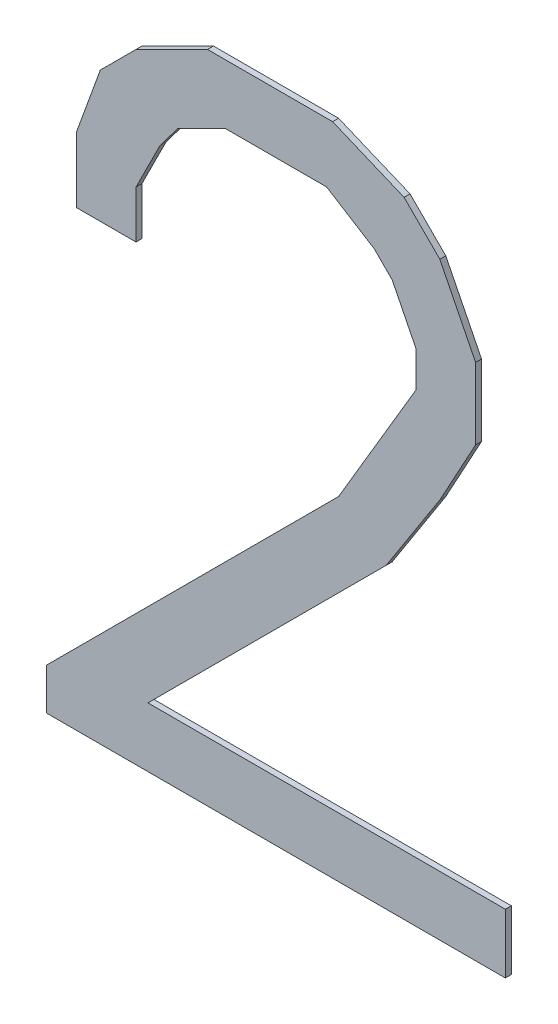
ISO-10303-21;
HEADER;
FILE_DESCRIPTION(('STEP AP214'),'2;1');
FILE_NAME('part.step','',(''),(''),'','','');
FILE_SCHEMA(('AUTOMOTIVE_DESIGN { 1 0 10303 214 1 1 1 1 }'));
ENDSEC;
DATA;
#1=APPLICATION_CONTEXT('core data for automotive mechanical design processes');
#2=APPLICATION_PROTOCOL_DEFINITION('international standard','automotive_design',2000,#1);
#3=PRODUCT_CONTEXT('',#1,'mechanical');
#4=PRODUCT('Part','Part','',(#3));
#5=PRODUCT_RELATED_PRODUCT_CATEGORY('part','',(#4));
#6=PRODUCT_DEFINITION_FORMATION('','',#4);
#7=PRODUCT_DEFINITION_CONTEXT('part definition',#1,'design');
#8=PRODUCT_DEFINITION('design','',#6,#7);
#9=PRODUCT_DEFINITION_SHAPE('','',#8);
#10=(LENGTH_UNIT() NAMED_UNIT(*) SI_UNIT(.MILLI.,.METRE.));
#11=(NAMED_UNIT(*) PLANE_ANGLE_UNIT() SI_UNIT($,.RADIAN.));
#12=(NAMED_UNIT(*) SI_UNIT($,.STERADIAN.) SOLID_ANGLE_UNIT());
#13=UNCERTAINTY_MEASURE_WITH_UNIT(LENGTH_MEASURE(1.E-05),#10,'distance_accuracy_value','');
#14=(GEOMETRIC_REPRESENTATION_CONTEXT(3) GLOBAL_UNCERTAINTY_ASSIGNED_CONTEXT((#13)) GLOBAL_UNIT_ASSIGNED_CONTEXT((#10,
#11,#12)) REPRESENTATION_CONTEXT('',''));
#15=CARTESIAN_POINT('',(0.,0.,0.));
#16=DIRECTION('',(0.,0.,1.));
#17=DIRECTION('',(1.,0.,0.));
#18=AXIS2_PLACEMENT_3D('',#15,#16,#17);
#19=CARTESIAN_POINT('',(-0.33499806,0.21000212,0.01));
#20=DIRECTION('',(0.,0.,-1.));
#21=DIRECTION('',(-1.,0.,0.));
#22=AXIS2_PLACEMENT_3D('',#19,#20,#21);
#23=PLANE('',#22);
#24=DIRECTION('',(-0.447213595499958,-0.894427190999916,0.));
#25=VECTOR('',#24,1.);
#26=CARTESIAN_POINT('',(-0.23499826,0.29000196,0.01));
#27=LINE('',#26,#25);
#28=CARTESIAN_POINT('',(-0.23499826,0.29000196,0.01));
#29=VERTEX_POINT('',#28);
#30=CARTESIAN_POINT('',(-0.19499834,0.3700018,0.01));
#31=VERTEX_POINT('',#30);
#32=EDGE_CURVE('E321',#29,#31,#27,.F.);
#33=ORIENTED_EDGE('',*,*,#32,.T.);
#34=DIRECTION('',(-0.6,-0.8,0.));
#35=VECTOR('',#34,1.);
#36=CARTESIAN_POINT('',(-0.19499834,0.3700018,0.01));
#37=LINE('',#36,#35);
#38=CARTESIAN_POINT('',(-0.1649984,0.41000172,0.01));
#39=VERTEX_POINT('',#38);
#40=EDGE_CURVE('E316',#31,#39,#37,.F.);
#41=ORIENTED_EDGE('',*,*,#40,.T.);
#42=DIRECTION('',(-0.894427190999916,-0.447213595499958,0.));
#43=VECTOR('',#42,1.);
#44=CARTESIAN_POINT('',(-0.1649984,0.41000172,0.01));
#45=LINE('',#44,#43);
#46=CARTESIAN_POINT('',(-0.0849985599999906,0.450001640000001,0.01));
#47=VERTEX_POINT('',#46);
#48=EDGE_CURVE('E312',#39,#47,#45,.F.);
#49=ORIENTED_EDGE('',*,*,#48,.T.);
#50=DIRECTION('',(1.,0.,0.));
#51=VECTOR('',#50,1.);
#52=CARTESIAN_POINT('',(-0.08499855999999,0.45000164,0.01));
#53=LINE('',#52,#51);
#54=CARTESIAN_POINT('',(0.08500110000001,0.45000164,0.01));
#55=VERTEX_POINT('',#54);
#56=EDGE_CURVE('E308',#47,#55,#53,.T.);
#57=ORIENTED_EDGE('',*,*,#56,.T.);
#58=DIRECTION('',(-0.847998304005144,0.52999894000309,0.));
#59=VECTOR('',#58,1.);
#60=CARTESIAN_POINT('',(0.08500110000001,0.45000164,0.01));
#61=LINE('',#60,#59);
#62=CARTESIAN_POINT('',(0.165000940000002,0.400001740000003,0.01));
#63=VERTEX_POINT('',#62);
#64=EDGE_CURVE('E304',#55,#63,#61,.F.);
#65=ORIENTED_EDGE('',*,*,#64,.T.);
#66=DIRECTION('',(-0.707106781186548,0.707106781186548,0.));
#67=VECTOR('',#66,1.);
#68=CARTESIAN_POINT('',(0.16500094,0.40000174,0.01));
#69=LINE('',#68,#67);
#70=CARTESIAN_POINT('',(0.19500088,0.3700018,0.01));
#71=VERTEX_POINT('',#70);
#72=EDGE_CURVE('E300',#63,#71,#69,.F.);
#73=ORIENTED_EDGE('',*,*,#72,.T.);
#74=DIRECTION('',(-0.447213595499958,0.894427190999916,0.));
#75=VECTOR('',#74,1.);
#76=CARTESIAN_POINT('',(0.19500088,0.3700018,0.01));
#77=LINE('',#76,#75);
#78=CARTESIAN_POINT('',(0.2350008,0.29000196,0.01));
#79=VERTEX_POINT('',#78);
#80=EDGE_CURVE('E296',#71,#79,#77,.F.);
#81=ORIENTED_EDGE('',*,*,#80,.T.);
#82=DIRECTION('',(0.,1.,0.));
#83=VECTOR('',#82,1.);
#84=CARTESIAN_POINT('',(0.2350008,0.29000196,0.01));
#85=LINE('',#84,#83);
#86=CARTESIAN_POINT('',(0.2350008,0.23000208,0.01));
#87=VERTEX_POINT('',#86);
#88=EDGE_CURVE('E292',#79,#87,#85,.F.);
#89=ORIENTED_EDGE('',*,*,#88,.T.);
#90=DIRECTION('',(0.508729312127045,0.860926528214077,0.));
#91=VECTOR('',#90,1.);
#92=CARTESIAN_POINT('',(0.2350008,0.23000208,0.01));
#93=LINE('',#92,#91);
#94=CARTESIAN_POINT('',(0.105001059999979,0.0100025200000318,0.01));
#95=VERTEX_POINT('',#94);
#96=EDGE_CURVE('E288',#87,#95,#93,.F.);
#97=ORIENTED_EDGE('',*,*,#96,.T.);
#98=DIRECTION('',(0.707104948480173,0.707108613888172,0.));
#99=VECTOR('',#98,1.);
#100=CARTESIAN_POINT('',(0.10500106,0.01000252,0.01));
#101=LINE('',#100,#99);
#102=CARTESIAN_POINT('',(-0.384997960000043,-0.479999039999957,0.01));
#103=VERTEX_POINT('',#102);
#104=EDGE_CURVE('E284',#95,#103,#101,.F.);
#105=ORIENTED_EDGE('',*,*,#104,.T.);
#106=DIRECTION('',(0.,1.,0.));
#107=VECTOR('',#106,1.);
#108=CARTESIAN_POINT('',(-0.38499796,-0.47999904,0.01));
#109=LINE('',#108,#107);
#110=CARTESIAN_POINT('',(-0.38499796,-0.5499989,0.01));
#111=VERTEX_POINT('',#110);
#112=EDGE_CURVE('E280',#103,#111,#109,.F.);
#113=ORIENTED_EDGE('',*,*,#112,.T.);
#114=DIRECTION('',(1.,0.,0.));
#115=VECTOR('',#114,1.);
#116=CARTESIAN_POINT('',(-0.38499796,-0.5499989,0.01));
#117=LINE('',#116,#115);
#118=CARTESIAN_POINT('',(0.3850005,-0.5499989,0.01));
#119=VERTEX_POINT('',#118);
#120=EDGE_CURVE('E276',#111,#119,#117,.T.);
#121=ORIENTED_EDGE('',*,*,#120,.T.);
#122=DIRECTION('',(0.,1.,0.));
#123=VECTOR('',#122,1.);
#124=CARTESIAN_POINT('',(0.3850005,-0.5499989,0.01));
#125=LINE('',#124,#123);
#126=CARTESIAN_POINT('',(0.3850005,-0.4499991,0.01));
#127=VERTEX_POINT('',#126);
#128=EDGE_CURVE('E272',#119,#127,#125,.T.);
#129=ORIENTED_EDGE('',*,*,#128,.T.);
#130=DIRECTION('',(1.,0.,0.));
#131=VECTOR('',#130,1.);
#132=CARTESIAN_POINT('',(0.3850005,-0.4499991,0.01));
#133=LINE('',#132,#131);
#134=CARTESIAN_POINT('',(-0.2149983,-0.4499991,0.01));
#135=VERTEX_POINT('',#134);
#136=EDGE_CURVE('E268',#127,#135,#133,.F.);
#137=ORIENTED_EDGE('',*,*,#136,.T.);
#138=DIRECTION('',(-0.707104536121984,-0.707109026243984,0.));
#139=VECTOR('',#138,1.);
#140=CARTESIAN_POINT('',(-0.2149983,-0.4499991,0.01));
#141=LINE('',#140,#139);
#142=CARTESIAN_POINT('',(0.185000900000042,-0.0499973600000949,0.01));
#143=VERTEX_POINT('',#142);
#144=EDGE_CURVE('E264',#135,#143,#141,.F.);
#145=ORIENTED_EDGE('',*,*,#144,.T.);
#146=DIRECTION('',(-0.540757591314105,-0.841178475376164,0.));
#147=VECTOR('',#146,1.);
#148=CARTESIAN_POINT('',(0.1850009,-0.04999735999999,0.01));
#149=LINE('',#148,#147);
#150=CARTESIAN_POINT('',(0.27500072000002,0.0900023599999678,0.01));
#151=VERTEX_POINT('',#150);
#152=EDGE_CURVE('E260',#143,#151,#149,.F.);
#153=ORIENTED_EDGE('',*,*,#152,.T.);
#154=DIRECTION('',(-0.478852130679873,-0.877895572914767,0.));
#155=VECTOR('',#154,1.);
#156=CARTESIAN_POINT('',(0.27500072,0.09000236,0.01));
#157=LINE('',#156,#155);
#158=CARTESIAN_POINT('',(0.335000599999978,0.200002140000012,0.01));
#159=VERTEX_POINT('',#158);
#160=EDGE_CURVE('E256',#151,#159,#157,.F.);
#161=ORIENTED_EDGE('',*,*,#160,.T.);
#162=DIRECTION('',(0.,1.,0.));
#163=VECTOR('',#162,1.);
#164=CARTESIAN_POINT('',(0.3350006,0.20000214,0.01));
#165=LINE('',#164,#163);
#166=CARTESIAN_POINT('',(0.3350006,0.3200019,0.01));
#167=VERTEX_POINT('',#166);
#168=EDGE_CURVE('E252',#159,#167,#165,.T.);
#169=ORIENTED_EDGE('',*,*,#168,.T.);
#170=DIRECTION('',(0.447213595499958,-0.894427190999916,0.));
#171=VECTOR('',#170,1.);
#172=CARTESIAN_POINT('',(0.3350006,0.3200019,0.01));
#173=LINE('',#172,#171);
#174=CARTESIAN_POINT('',(0.27500072,0.44000166,0.01));
#175=VERTEX_POINT('',#174);
#176=EDGE_CURVE('E248',#167,#175,#173,.F.);
#177=ORIENTED_EDGE('',*,*,#176,.T.);
#178=DIRECTION('',(0.707106781186548,-0.707106781186548,0.));
#179=VECTOR('',#178,1.);
#180=CARTESIAN_POINT('',(0.27500072,0.44000166,0.01));
#181=LINE('',#180,#179);
#182=CARTESIAN_POINT('',(0.21500084,0.50000154,0.01));
#183=VERTEX_POINT('',#182);
#184=EDGE_CURVE('E244',#175,#183,#181,.F.);
#185=ORIENTED_EDGE('',*,*,#184,.T.);
#186=DIRECTION('',(0.923076923077071,-0.38461538461503,0.));
#187=VECTOR('',#186,1.);
#188=CARTESIAN_POINT('',(0.21500084,0.50000154,0.01));
#189=LINE('',#188,#187);
#190=CARTESIAN_POINT('',(0.0950010799999954,0.550001439999988,0.01));
#191=VERTEX_POINT('',#190);
#192=EDGE_CURVE('E240',#183,#191,#189,.F.);
#193=ORIENTED_EDGE('',*,*,#192,.T.);
#194=DIRECTION('',(1.,0.,0.));
#195=VECTOR('',#194,1.);
#196=CARTESIAN_POINT('',(0.09500108,0.55000144,0.01));
#197=LINE('',#196,#195);
#198=CARTESIAN_POINT('',(-0.1149985,0.55000144,0.01));
#199=VERTEX_POINT('',#198);
#200=EDGE_CURVE('E236',#191,#199,#197,.F.);
#201=ORIENTED_EDGE('',*,*,#200,.T.);
#202=DIRECTION('',(0.894427190999916,0.447213595499958,0.));
#203=VECTOR('',#202,1.);
#204=CARTESIAN_POINT('',(-0.1149985,0.55000144,0.01));
#205=LINE('',#204,#203);
#206=CARTESIAN_POINT('',(-0.23499826,0.49000156,0.01));
#207=VERTEX_POINT('',#206);
#208=EDGE_CURVE('E232',#199,#207,#205,.F.);
#209=ORIENTED_EDGE('',*,*,#208,.T.);
#210=DIRECTION('',(0.707106781186048,0.707106781187048,0.));
#211=VECTOR('',#210,1.);
#212=CARTESIAN_POINT('',(-0.23499826,0.49000156,0.01));
#213=LINE('',#212,#211);
#214=CARTESIAN_POINT('',(-0.294998139999989,0.430001679999989,0.01));
#215=VERTEX_POINT('',#214);
#216=EDGE_CURVE('E228',#207,#215,#213,.F.);
#217=ORIENTED_EDGE('',*,*,#216,.T.);
#218=DIRECTION('',(0.341743063087106,0.939793423488291,0.));
#219=VECTOR('',#218,1.);
#220=CARTESIAN_POINT('',(-0.29499814,0.43000168,0.01));
#221=LINE('',#220,#219);
#222=CARTESIAN_POINT('',(-0.334998060000012,0.320001900000004,0.01));
#223=VERTEX_POINT('',#222);
#224=EDGE_CURVE('E224',#215,#223,#221,.F.);
#225=ORIENTED_EDGE('',*,*,#224,.T.);
#226=DIRECTION('',(0.,1.,0.));
#227=VECTOR('',#226,1.);
#228=CARTESIAN_POINT('',(-0.33499806,0.3200019,0.01));
#229=LINE('',#228,#227);
#230=CARTESIAN_POINT('',(-0.33499806,0.21000212,0.01));
#231=VERTEX_POINT('',#230);
#232=EDGE_CURVE('E200',#223,#231,#229,.F.);
#233=ORIENTED_EDGE('',*,*,#232,.T.);
#234=DIRECTION('',(1.,0.,0.));
#235=VECTOR('',#234,1.);
#236=CARTESIAN_POINT('',(-0.33499806,0.21000212,0.01));
#237=LINE('',#236,#235);
#238=CARTESIAN_POINT('',(-0.23499826,0.21000212,0.01));
#239=VERTEX_POINT('',#238);
#240=EDGE_CURVE('E202',#231,#239,#237,.T.);
#241=ORIENTED_EDGE('',*,*,#240,.T.);
#242=DIRECTION('',(0.,1.,0.));
#243=VECTOR('',#242,1.);
#244=CARTESIAN_POINT('',(-0.23499826,0.21000212,0.01));
#245=LINE('',#244,#243);
#246=EDGE_CURVE('E20',#239,#29,#245,.T.);
#247=ORIENTED_EDGE('',*,*,#246,.T.);
#248=EDGE_LOOP('',(#33,#41,#49,#57,#65,#73,#81,#89,#97,#105,#113,#121,#129,#137,#145,#153,#161,
#169,#177,#185,#193,#201,#209,#217,#225,#233,#241,#247));
#249=FACE_BOUND('',#248,.T.);
#250=ADVANCED_FACE('F17',(#249),#23,.F.);
#251=CARTESIAN_POINT('',(-0.23499826,0.21000212,0.));
#252=DIRECTION('',(-1.,0.,0.));
#253=DIRECTION('',(0.,0.,1.));
#254=AXIS2_PLACEMENT_3D('',#251,#252,#253);
#255=PLANE('',#254);
#256=ORIENTED_EDGE('',*,*,#246,.F.);
#257=DIRECTION('',(0.,0.,1.));
#258=VECTOR('',#257,1.);
#259=CARTESIAN_POINT('',(-0.23499826,0.21000212,0.));
#260=LINE('',#259,#258);
#261=CARTESIAN_POINT('',(-0.23499826,0.21000212,0.));
#262=VERTEX_POINT('',#261);
#263=EDGE_CURVE('E208',#239,#262,#260,.F.);
#264=ORIENTED_EDGE('',*,*,#263,.T.);
#265=DIRECTION('',(0.,1.,0.));
#266=VECTOR('',#265,1.);
#267=CARTESIAN_POINT('',(-0.23499826,0.21000212,0.));
#268=LINE('',#267,#266);
#269=CARTESIAN_POINT('',(-0.23499826,0.29000196,0.));
#270=VERTEX_POINT('',#269);
#271=EDGE_CURVE('E324',#270,#262,#268,.F.);
#272=ORIENTED_EDGE('',*,*,#271,.F.);
#273=DIRECTION('',(0.,0.,1.));
#274=VECTOR('',#273,1.);
#275=CARTESIAN_POINT('',(-0.23499826,0.29000196,0.));
#276=LINE('',#275,#274);
#277=EDGE_CURVE('E213',#270,#29,#276,.T.);
#278=ORIENTED_EDGE('',*,*,#277,.T.);
#279=EDGE_LOOP('',(#256,#264,#272,#278));
#280=FACE_BOUND('',#279,.T.);
#281=ADVANCED_FACE('F210',(#280),#255,.F.);
#282=CARTESIAN_POINT('',(-0.33499806,0.21000212,0.));
#283=DIRECTION('',(0.,1.,0.));
#284=DIRECTION('',(0.,0.,1.));
#285=AXIS2_PLACEMENT_3D('',#282,#283,#284);
#286=PLANE('',#285);
#287=ORIENTED_EDGE('',*,*,#240,.F.);
#288=DIRECTION('',(0.,0.,-1.));
#289=VECTOR('',#288,1.);
#290=CARTESIAN_POINT('',(-0.33499806,0.21000212,0.));
#291=LINE('',#290,#289);
#292=CARTESIAN_POINT('',(-0.33499806,0.21000212,0.));
#293=VERTEX_POINT('',#292);
#294=EDGE_CURVE('E220',#231,#293,#291,.T.);
#295=ORIENTED_EDGE('',*,*,#294,.T.);
#296=DIRECTION('',(-1.,0.,0.));
#297=VECTOR('',#296,1.);
#298=CARTESIAN_POINT('',(-0.33499806,0.21000212,0.));
#299=LINE('',#298,#297);
#300=EDGE_CURVE('E217',#262,#293,#299,.T.);
#301=ORIENTED_EDGE('',*,*,#300,.F.);
#302=ORIENTED_EDGE('',*,*,#263,.F.);
#303=EDGE_LOOP('',(#287,#295,#301,#302));
#304=FACE_BOUND('',#303,.T.);
#305=ADVANCED_FACE('F215',(#304),#286,.F.);
#306=CARTESIAN_POINT('',(-0.33499806,0.3200019,0.));
#307=DIRECTION('',(1.,0.,0.));
#308=DIRECTION('',(0.,0.,-1.));
#309=AXIS2_PLACEMENT_3D('',#306,#307,#308);
#310=PLANE('',#309);
#311=ORIENTED_EDGE('',*,*,#232,.F.);
#312=DIRECTION('',(0.,0.,1.));
#313=VECTOR('',#312,1.);
#314=CARTESIAN_POINT('',(-0.334998060000047,0.320001900000017,0.));
#315=LINE('',#314,#313);
#316=CARTESIAN_POINT('',(-0.334998060000012,0.320001900000004,0.));
#317=VERTEX_POINT('',#316);
#318=EDGE_CURVE('E226',#223,#317,#315,.F.);
#319=ORIENTED_EDGE('',*,*,#318,.T.);
#320=DIRECTION('',(0.,1.,0.));
#321=VECTOR('',#320,1.);
#322=CARTESIAN_POINT('',(-0.33499806,0.21000212,0.));
#323=LINE('',#322,#321);
#324=EDGE_CURVE('E327',#293,#317,#323,.T.);
#325=ORIENTED_EDGE('',*,*,#324,.F.);
#326=ORIENTED_EDGE('',*,*,#294,.F.);
#327=EDGE_LOOP('',(#311,#319,#325,#326));
#328=FACE_BOUND('',#327,.T.);
#329=ADVANCED_FACE('F520',(#328),#310,.F.);
#330=CARTESIAN_POINT('',(-0.29499814,0.43000168,0.));
#331=DIRECTION('',(0.939793423488291,-0.341743063087106,0.));
#332=DIRECTION('',(0.341743063087106,0.939793423488291,0.));
#333=AXIS2_PLACEMENT_3D('',#330,#331,#332);
#334=PLANE('',#333);
#335=ORIENTED_EDGE('',*,*,#224,.F.);
#336=DIRECTION('',(0.,0.,1.));
#337=VECTOR('',#336,1.);
#338=CARTESIAN_POINT('',(-0.294998139999958,0.430001679999958,0.));
#339=LINE('',#338,#337);
#340=CARTESIAN_POINT('',(-0.294998139999989,0.430001679999989,0.));
#341=VERTEX_POINT('',#340);
#342=EDGE_CURVE('E230',#215,#341,#339,.F.);
#343=ORIENTED_EDGE('',*,*,#342,.T.);
#344=DIRECTION('',(0.341743063086704,0.939793423488437,0.));
#345=VECTOR('',#344,1.);
#346=CARTESIAN_POINT('',(-0.33499806,0.3200019,0.));
#347=LINE('',#346,#345);
#348=EDGE_CURVE('E330',#317,#341,#347,.T.);
#349=ORIENTED_EDGE('',*,*,#348,.F.);
#350=ORIENTED_EDGE('',*,*,#318,.F.);
#351=EDGE_LOOP('',(#335,#343,#349,#350));
#352=FACE_BOUND('',#351,.T.);
#353=ADVANCED_FACE('F517',(#352),#334,.F.);
#354=CARTESIAN_POINT('',(-0.23499826,0.49000156,0.));
#355=DIRECTION('',(0.707106781187048,-0.707106781186048,0.));
#356=DIRECTION('',(0.707106781186048,0.707106781187048,0.));
#357=AXIS2_PLACEMENT_3D('',#354,#355,#356);
#358=PLANE('',#357);
#359=ORIENTED_EDGE('',*,*,#216,.F.);
#360=DIRECTION('',(0.,0.,1.));
#361=VECTOR('',#360,1.);
#362=CARTESIAN_POINT('',(-0.23499826,0.49000156,0.));
#363=LINE('',#362,#361);
#364=CARTESIAN_POINT('',(-0.23499826,0.49000156,0.));
#365=VERTEX_POINT('',#364);
#366=EDGE_CURVE('E234',#207,#365,#363,.F.);
#367=ORIENTED_EDGE('',*,*,#366,.T.);
#368=DIRECTION('',(0.707106781186548,0.707106781186548,0.));
#369=VECTOR('',#368,1.);
#370=CARTESIAN_POINT('',(-0.29499814,0.43000168,0.));
#371=LINE('',#370,#369);
#372=EDGE_CURVE('E333',#341,#365,#371,.T.);
#373=ORIENTED_EDGE('',*,*,#372,.F.);
#374=ORIENTED_EDGE('',*,*,#342,.F.);
#375=EDGE_LOOP('',(#359,#367,#373,#374));
#376=FACE_BOUND('',#375,.T.);
#377=ADVANCED_FACE('F513',(#376),#358,.F.);
#378=CARTESIAN_POINT('',(-0.1149985,0.55000144,0.));
#379=DIRECTION('',(0.447213595499958,-0.894427190999916,0.));
#380=DIRECTION('',(0.894427190999916,0.447213595499958,0.));
#381=AXIS2_PLACEMENT_3D('',#378,#379,#380);
#382=PLANE('',#381);
#383=ORIENTED_EDGE('',*,*,#208,.F.);
#384=DIRECTION('',(0.,0.,-1.));
#385=VECTOR('',#384,1.);
#386=CARTESIAN_POINT('',(-0.1149985,0.55000144,0.));
#387=LINE('',#386,#385);
#388=CARTESIAN_POINT('',(-0.1149985,0.55000144,0.));
#389=VERTEX_POINT('',#388);
#390=EDGE_CURVE('E238',#199,#389,#387,.T.);
#391=ORIENTED_EDGE('',*,*,#390,.T.);
#392=DIRECTION('',(0.894427190999916,0.447213595499957,0.));
#393=VECTOR('',#392,1.);
#394=CARTESIAN_POINT('',(-0.23499826,0.49000156,0.));
#395=LINE('',#394,#393);
#396=EDGE_CURVE('E336',#365,#389,#395,.T.);
#397=ORIENTED_EDGE('',*,*,#396,.F.);
#398=ORIENTED_EDGE('',*,*,#366,.F.);
#399=EDGE_LOOP('',(#383,#391,#397,#398));
#400=FACE_BOUND('',#399,.T.);
#401=ADVANCED_FACE('F507',(#400),#382,.F.);
#402=CARTESIAN_POINT('',(0.09500108,0.55000144,0.));
#403=DIRECTION('',(0.,-1.,0.));
#404=DIRECTION('',(0.,0.,-1.));
#405=AXIS2_PLACEMENT_3D('',#402,#403,#404);
#406=PLANE('',#405);
#407=ORIENTED_EDGE('',*,*,#200,.F.);
#408=DIRECTION('',(0.,0.,1.));
#409=VECTOR('',#408,1.);
#410=CARTESIAN_POINT('',(0.0950010799999808,0.550001439999954,0.));
#411=LINE('',#410,#409);
#412=CARTESIAN_POINT('',(0.0950010799999953,0.550001439999988,0.));
#413=VERTEX_POINT('',#412);
#414=EDGE_CURVE('E242',#191,#413,#411,.F.);
#415=ORIENTED_EDGE('',*,*,#414,.T.);
#416=DIRECTION('',(-1.,0.,0.));
#417=VECTOR('',#416,1.);
#418=CARTESIAN_POINT('',(-0.33499806,0.55000144,0.));
#419=LINE('',#418,#417);
#420=EDGE_CURVE('E339',#389,#413,#419,.F.);
#421=ORIENTED_EDGE('',*,*,#420,.F.);
#422=ORIENTED_EDGE('',*,*,#390,.F.);
#423=EDGE_LOOP('',(#407,#415,#421,#422));
#424=FACE_BOUND('',#423,.T.);
#425=ADVANCED_FACE('F503',(#424),#406,.F.);
#426=CARTESIAN_POINT('',(0.21500084,0.50000154,0.));
#427=DIRECTION('',(-0.38461538461503,-0.923076923077071,0.));
#428=DIRECTION('',(0.923076923077071,-0.38461538461503,0.));
#429=AXIS2_PLACEMENT_3D('',#426,#427,#428);
#430=PLANE('',#429);
#431=ORIENTED_EDGE('',*,*,#192,.F.);
#432=DIRECTION('',(0.,0.,1.));
#433=VECTOR('',#432,1.);
#434=CARTESIAN_POINT('',(0.21500084,0.50000154,0.));
#435=LINE('',#434,#433);
#436=CARTESIAN_POINT('',(0.21500084,0.50000154,0.));
#437=VERTEX_POINT('',#436);
#438=EDGE_CURVE('E246',#183,#437,#435,.F.);
#439=ORIENTED_EDGE('',*,*,#438,.T.);
#440=DIRECTION('',(0.923076923076923,-0.384615384615385,0.));
#441=VECTOR('',#440,1.);
#442=CARTESIAN_POINT('',(0.09500108,0.55000144,0.));
#443=LINE('',#442,#441);
#444=EDGE_CURVE('E342',#413,#437,#443,.T.);
#445=ORIENTED_EDGE('',*,*,#444,.F.);
#446=ORIENTED_EDGE('',*,*,#414,.F.);
#447=EDGE_LOOP('',(#431,#439,#445,#446));
#448=FACE_BOUND('',#447,.T.);
#449=ADVANCED_FACE('F497',(#448),#430,.F.);
#450=CARTESIAN_POINT('',(0.27500072,0.44000166,0.));
#451=DIRECTION('',(-0.707106781186548,-0.707106781186548,0.));
#452=DIRECTION('',(0.707106781186548,-0.707106781186548,0.));
#453=AXIS2_PLACEMENT_3D('',#450,#451,#452);
#454=PLANE('',#453);
#455=ORIENTED_EDGE('',*,*,#184,.F.);
#456=DIRECTION('',(0.,0.,1.));
#457=VECTOR('',#456,1.);
#458=CARTESIAN_POINT('',(0.27500072,0.44000166,0.));
#459=LINE('',#458,#457);
#460=CARTESIAN_POINT('',(0.27500072,0.44000166,0.));
#461=VERTEX_POINT('',#460);
#462=EDGE_CURVE('E250',#175,#461,#459,.F.);
#463=ORIENTED_EDGE('',*,*,#462,.T.);
#464=DIRECTION('',(0.707106781186548,-0.707106781186547,0.));
#465=VECTOR('',#464,1.);
#466=CARTESIAN_POINT('',(0.21500084,0.50000154,0.));
#467=LINE('',#466,#465);
#468=EDGE_CURVE('E345',#437,#461,#467,.T.);
#469=ORIENTED_EDGE('',*,*,#468,.F.);
#470=ORIENTED_EDGE('',*,*,#438,.F.);
#471=EDGE_LOOP('',(#455,#463,#469,#470));
#472=FACE_BOUND('',#471,.T.);
#473=ADVANCED_FACE('F493',(#472),#454,.F.);
#474=CARTESIAN_POINT('',(0.3350006,0.3200019,0.));
#475=DIRECTION('',(-0.894427190999916,-0.447213595499958,0.));
#476=DIRECTION('',(0.447213595499958,-0.894427190999916,0.));
#477=AXIS2_PLACEMENT_3D('',#474,#475,#476);
#478=PLANE('',#477);
#479=ORIENTED_EDGE('',*,*,#176,.F.);
#480=DIRECTION('',(0.,0.,1.));
#481=VECTOR('',#480,1.);
#482=CARTESIAN_POINT('',(0.3350006,0.3200019,0.));
#483=LINE('',#482,#481);
#484=CARTESIAN_POINT('',(0.3350006,0.3200019,0.));
#485=VERTEX_POINT('',#484);
#486=EDGE_CURVE('E254',#167,#485,#483,.F.);
#487=ORIENTED_EDGE('',*,*,#486,.T.);
#488=DIRECTION('',(0.447213595499958,-0.894427190999916,0.));
#489=VECTOR('',#488,1.);
#490=CARTESIAN_POINT('',(0.27500072,0.44000166,0.));
#491=LINE('',#490,#489);
#492=EDGE_CURVE('E348',#461,#485,#491,.T.);
#493=ORIENTED_EDGE('',*,*,#492,.F.);
#494=ORIENTED_EDGE('',*,*,#462,.F.);
#495=EDGE_LOOP('',(#479,#487,#493,#494));
#496=FACE_BOUND('',#495,.T.);
#497=ADVANCED_FACE('F487',(#496),#478,.F.);
#498=CARTESIAN_POINT('',(0.3350006,0.20000214,0.));
#499=DIRECTION('',(-1.,0.,0.));
#500=DIRECTION('',(0.,0.,1.));
#501=AXIS2_PLACEMENT_3D('',#498,#499,#500);
#502=PLANE('',#501);
#503=ORIENTED_EDGE('',*,*,#168,.F.);
#504=DIRECTION('',(0.,0.,1.));
#505=VECTOR('',#504,1.);
#506=CARTESIAN_POINT('',(0.335000599999912,0.200002140000048,0.));
#507=LINE('',#506,#505);
#508=CARTESIAN_POINT('',(0.335000599999978,0.200002140000012,0.));
#509=VERTEX_POINT('',#508);
#510=EDGE_CURVE('E258',#159,#509,#507,.F.);
#511=ORIENTED_EDGE('',*,*,#510,.T.);
#512=DIRECTION('',(0.,1.,0.));
#513=VECTOR('',#512,1.);
#514=CARTESIAN_POINT('',(0.3350006,0.21000212,0.));
#515=LINE('',#514,#513);
#516=EDGE_CURVE('E351',#485,#509,#515,.F.);
#517=ORIENTED_EDGE('',*,*,#516,.F.);
#518=ORIENTED_EDGE('',*,*,#486,.F.);
#519=EDGE_LOOP('',(#503,#511,#517,#518));
#520=FACE_BOUND('',#519,.T.);
#521=ADVANCED_FACE('F483',(#520),#502,.F.);
#522=CARTESIAN_POINT('',(0.27500072,0.09000236,0.));
#523=DIRECTION('',(-0.877895572914767,0.478852130679873,0.));
#524=DIRECTION('',(-0.478852130679873,-0.877895572914767,0.));
#525=AXIS2_PLACEMENT_3D('',#522,#523,#524);
#526=PLANE('',#525);
#527=ORIENTED_EDGE('',*,*,#160,.F.);
#528=DIRECTION('',(0.,0.,1.));
#529=VECTOR('',#528,1.);
#530=CARTESIAN_POINT('',(0.275000720000087,0.0900023599999239,0.));
#531=LINE('',#530,#529);
#532=CARTESIAN_POINT('',(0.275000720000018,0.0900023599999686,0.));
#533=VERTEX_POINT('',#532);
#534=EDGE_CURVE('E262',#151,#533,#531,.F.);
#535=ORIENTED_EDGE('',*,*,#534,.T.);
#536=DIRECTION('',(-0.478852130680506,-0.877895572914421,0.));
#537=VECTOR('',#536,1.);
#538=CARTESIAN_POINT('',(0.3350006,0.20000214,0.));
#539=LINE('',#538,#537);
#540=EDGE_CURVE('E354',#509,#533,#539,.T.);
#541=ORIENTED_EDGE('',*,*,#540,.F.);
#542=ORIENTED_EDGE('',*,*,#510,.F.);
#543=EDGE_LOOP('',(#527,#535,#541,#542));
#544=FACE_BOUND('',#543,.T.);
#545=ADVANCED_FACE('F477',(#544),#526,.F.);
#546=CARTESIAN_POINT('',(0.1850009,-0.04999735999999,0.));
#547=DIRECTION('',(-0.841178475376164,0.540757591314105,0.));
#548=DIRECTION('',(-0.540757591314105,-0.841178475376164,0.));
#549=AXIS2_PLACEMENT_3D('',#546,#547,#548);
#550=PLANE('',#549);
#551=ORIENTED_EDGE('',*,*,#152,.F.);
#552=DIRECTION('',(0.,0.,1.));
#553=VECTOR('',#552,1.);
#554=CARTESIAN_POINT('',(0.185000900000197,-0.0499973600002469,0.));
#555=LINE('',#554,#553);
#556=CARTESIAN_POINT('',(0.185000900000036,-0.0499973600000905,0.));
#557=VERTEX_POINT('',#556);
#558=EDGE_CURVE('E266',#143,#557,#555,.F.);
#559=ORIENTED_EDGE('',*,*,#558,.T.);
#560=DIRECTION('',(-0.540757591313417,-0.841178475376606,0.));
#561=VECTOR('',#560,1.);
#562=CARTESIAN_POINT('',(0.27500072,0.09000235999998,0.));
#563=LINE('',#562,#561);
#564=EDGE_CURVE('E357',#533,#557,#563,.T.);
#565=ORIENTED_EDGE('',*,*,#564,.F.);
#566=ORIENTED_EDGE('',*,*,#534,.F.);
#567=EDGE_LOOP('',(#551,#559,#565,#566));
#568=FACE_BOUND('',#567,.T.);
#569=ADVANCED_FACE('F473',(#568),#550,.F.);
#570=CARTESIAN_POINT('',(-0.2149983,-0.4499991,0.));
#571=DIRECTION('',(-0.707109026243984,0.707104536121984,0.));
#572=DIRECTION('',(-0.707104536121984,-0.707109026243984,0.));
#573=AXIS2_PLACEMENT_3D('',#570,#571,#572);
#574=PLANE('',#573);
#575=ORIENTED_EDGE('',*,*,#144,.F.);
#576=DIRECTION('',(0.,0.,-1.));
#577=VECTOR('',#576,1.);
#578=CARTESIAN_POINT('',(-0.2149983,-0.4499991,0.));
#579=LINE('',#578,#577);
#580=CARTESIAN_POINT('',(-0.2149983,-0.4499991,0.));
#581=VERTEX_POINT('',#580);
#582=EDGE_CURVE('E270',#135,#581,#579,.T.);
#583=ORIENTED_EDGE('',*,*,#582,.T.);
#584=DIRECTION('',(-0.707104536121635,-0.707109026244332,0.));
#585=VECTOR('',#584,1.);
#586=CARTESIAN_POINT('',(0.1850009,-0.04999736000005,0.));
#587=LINE('',#586,#585);
#588=EDGE_CURVE('E360',#557,#581,#587,.T.);
#589=ORIENTED_EDGE('',*,*,#588,.F.);
#590=ORIENTED_EDGE('',*,*,#558,.F.);
#591=EDGE_LOOP('',(#575,#583,#589,#590));
#592=FACE_BOUND('',#591,.T.);
#593=ADVANCED_FACE('F467',(#592),#574,.F.);
#594=CARTESIAN_POINT('',(0.3850005,-0.4499991,0.));
#595=DIRECTION('',(0.,-1.,0.));
#596=DIRECTION('',(0.,0.,-1.));
#597=AXIS2_PLACEMENT_3D('',#594,#595,#596);
#598=PLANE('',#597);
#599=ORIENTED_EDGE('',*,*,#136,.F.);
#600=DIRECTION('',(0.,0.,1.));
#601=VECTOR('',#600,1.);
#602=CARTESIAN_POINT('',(0.3850005,-0.4499991,0.));
#603=LINE('',#602,#601);
#604=CARTESIAN_POINT('',(0.3850005,-0.4499991,0.));
#605=VERTEX_POINT('',#604);
#606=EDGE_CURVE('E274',#127,#605,#603,.F.);
#607=ORIENTED_EDGE('',*,*,#606,.T.);
#608=DIRECTION('',(-1.,0.,0.));
#609=VECTOR('',#608,1.);
#610=CARTESIAN_POINT('',(-0.33499806,-0.4499991,0.));
#611=LINE('',#610,#609);
#612=EDGE_CURVE('E363',#581,#605,#611,.F.);
#613=ORIENTED_EDGE('',*,*,#612,.F.);
#614=ORIENTED_EDGE('',*,*,#582,.F.);
#615=EDGE_LOOP('',(#599,#607,#613,#614));
#616=FACE_BOUND('',#615,.T.);
#617=ADVANCED_FACE('F463',(#616),#598,.F.);
#618=CARTESIAN_POINT('',(0.3850005,-0.5499989,0.));
#619=DIRECTION('',(-1.,0.,0.));
#620=DIRECTION('',(0.,0.,1.));
#621=AXIS2_PLACEMENT_3D('',#618,#619,#620);
#622=PLANE('',#621);
#623=ORIENTED_EDGE('',*,*,#128,.F.);
#624=DIRECTION('',(0.,0.,1.));
#625=VECTOR('',#624,1.);
#626=CARTESIAN_POINT('',(0.3850005,-0.5499989,0.));
#627=LINE('',#626,#625);
#628=CARTESIAN_POINT('',(0.3850005,-0.5499989,0.));
#629=VERTEX_POINT('',#628);
#630=EDGE_CURVE('E278',#119,#629,#627,.F.);
#631=ORIENTED_EDGE('',*,*,#630,.T.);
#632=DIRECTION('',(0.,1.,0.));
#633=VECTOR('',#632,1.);
#634=CARTESIAN_POINT('',(0.3850005,0.21000212,0.));
#635=LINE('',#634,#633);
#636=EDGE_CURVE('E366',#605,#629,#635,.F.);
#637=ORIENTED_EDGE('',*,*,#636,.F.);
#638=ORIENTED_EDGE('',*,*,#606,.F.);
#639=EDGE_LOOP('',(#623,#631,#637,#638));
#640=FACE_BOUND('',#639,.T.);
#641=ADVANCED_FACE('F457',(#640),#622,.F.);
#642=CARTESIAN_POINT('',(-0.38499796,-0.5499989,0.));
#643=DIRECTION('',(0.,1.,0.));
#644=DIRECTION('',(0.,0.,1.));
#645=AXIS2_PLACEMENT_3D('',#642,#643,#644);
#646=PLANE('',#645);
#647=ORIENTED_EDGE('',*,*,#120,.F.);
#648=DIRECTION('',(0.,0.,-1.));
#649=VECTOR('',#648,1.);
#650=CARTESIAN_POINT('',(-0.38499796,-0.5499989,0.));
#651=LINE('',#650,#649);
#652=CARTESIAN_POINT('',(-0.38499796,-0.5499989,0.));
#653=VERTEX_POINT('',#652);
#654=EDGE_CURVE('E282',#111,#653,#651,.T.);
#655=ORIENTED_EDGE('',*,*,#654,.T.);
#656=DIRECTION('',(-1.,0.,0.));
#657=VECTOR('',#656,1.);
#658=CARTESIAN_POINT('',(-0.33499806,-0.5499989,0.));
#659=LINE('',#658,#657);
#660=EDGE_CURVE('E369',#629,#653,#659,.T.);
#661=ORIENTED_EDGE('',*,*,#660,.F.);
#662=ORIENTED_EDGE('',*,*,#630,.F.);
#663=EDGE_LOOP('',(#647,#655,#661,#662));
#664=FACE_BOUND('',#663,.T.);
#665=ADVANCED_FACE('F453',(#664),#646,.F.);
#666=CARTESIAN_POINT('',(-0.38499796,-0.47999904,0.));
#667=DIRECTION('',(1.,0.,0.));
#668=DIRECTION('',(0.,0.,-1.));
#669=AXIS2_PLACEMENT_3D('',#666,#667,#668);
#670=PLANE('',#669);
#671=ORIENTED_EDGE('',*,*,#112,.F.);
#672=DIRECTION('',(0.,0.,1.));
#673=VECTOR('',#672,1.);
#674=CARTESIAN_POINT('',(-0.384997960000171,-0.47999903999983,0.));
#675=LINE('',#674,#673);
#676=CARTESIAN_POINT('',(-0.384997960000043,-0.479999039999957,0.));
#677=VERTEX_POINT('',#676);
#678=EDGE_CURVE('E286',#103,#677,#675,.F.);
#679=ORIENTED_EDGE('',*,*,#678,.T.);
#680=DIRECTION('',(0.,1.,0.));
#681=VECTOR('',#680,1.);
#682=CARTESIAN_POINT('',(-0.38499796,0.21000212,0.));
#683=LINE('',#682,#681);
#684=EDGE_CURVE('E372',#653,#677,#683,.T.);
#685=ORIENTED_EDGE('',*,*,#684,.F.);
#686=ORIENTED_EDGE('',*,*,#654,.F.);
#687=EDGE_LOOP('',(#671,#679,#685,#686));
#688=FACE_BOUND('',#687,.T.);
#689=ADVANCED_FACE('F447',(#688),#670,.F.);
#690=CARTESIAN_POINT('',(0.10500106,0.01000252,0.));
#691=DIRECTION('',(0.707108613888172,-0.707104948480173,0.));
#692=DIRECTION('',(0.707104948480173,0.707108613888172,0.));
#693=AXIS2_PLACEMENT_3D('',#690,#691,#692);
#694=PLANE('',#693);
#695=ORIENTED_EDGE('',*,*,#104,.F.);
#696=DIRECTION('',(0.,0.,1.));
#697=VECTOR('',#696,1.);
#698=CARTESIAN_POINT('',(0.105001059999905,0.0100025200000759,0.));
#699=LINE('',#698,#697);
#700=CARTESIAN_POINT('',(0.105001059999982,0.0100025200000292,0.));
#701=VERTEX_POINT('',#700);
#702=EDGE_CURVE('E290',#95,#701,#699,.F.);
#703=ORIENTED_EDGE('',*,*,#702,.T.);
#704=DIRECTION('',(0.707104948479912,0.707108613888433,0.));
#705=VECTOR('',#704,1.);
#706=CARTESIAN_POINT('',(-0.38499796,-0.47999904,0.));
#707=LINE('',#706,#705);
#708=EDGE_CURVE('E375',#677,#701,#707,.T.);
#709=ORIENTED_EDGE('',*,*,#708,.F.);
#710=ORIENTED_EDGE('',*,*,#678,.F.);
#711=EDGE_LOOP('',(#695,#703,#709,#710));
#712=FACE_BOUND('',#711,.T.);
#713=ADVANCED_FACE('F443',(#712),#694,.F.);
#714=CARTESIAN_POINT('',(0.2350008,0.23000208,0.));
#715=DIRECTION('',(0.860926528214077,-0.508729312127045,0.));
#716=DIRECTION('',(0.508729312127045,0.860926528214077,0.));
#717=AXIS2_PLACEMENT_3D('',#714,#715,#716);
#718=PLANE('',#717);
#719=ORIENTED_EDGE('',*,*,#96,.F.);
#720=DIRECTION('',(0.,0.,-1.));
#721=VECTOR('',#720,1.);
#722=CARTESIAN_POINT('',(0.2350008,0.23000208,0.));
#723=LINE('',#722,#721);
#724=CARTESIAN_POINT('',(0.2350008,0.23000208,0.));
#725=VERTEX_POINT('',#724);
#726=EDGE_CURVE('E294',#87,#725,#723,.T.);
#727=ORIENTED_EDGE('',*,*,#726,.T.);
#728=DIRECTION('',(0.508729312126675,0.860926528214295,0.));
#729=VECTOR('',#728,1.);
#730=CARTESIAN_POINT('',(0.10500106,0.01000252000002,0.));
#731=LINE('',#730,#729);
#732=EDGE_CURVE('E378',#701,#725,#731,.T.);
#733=ORIENTED_EDGE('',*,*,#732,.F.);
#734=ORIENTED_EDGE('',*,*,#702,.F.);
#735=EDGE_LOOP('',(#719,#727,#733,#734));
#736=FACE_BOUND('',#735,.T.);
#737=ADVANCED_FACE('F437',(#736),#718,.F.);
#738=CARTESIAN_POINT('',(0.2350008,0.29000196,0.));
#739=DIRECTION('',(1.,0.,0.));
#740=DIRECTION('',(0.,0.,-1.));
#741=AXIS2_PLACEMENT_3D('',#738,#739,#740);
#742=PLANE('',#741);
#743=ORIENTED_EDGE('',*,*,#88,.F.);
#744=DIRECTION('',(0.,0.,1.));
#745=VECTOR('',#744,1.);
#746=CARTESIAN_POINT('',(0.2350008,0.29000196,0.));
#747=LINE('',#746,#745);
#748=CARTESIAN_POINT('',(0.2350008,0.29000196,0.));
#749=VERTEX_POINT('',#748);
#750=EDGE_CURVE('E298',#79,#749,#747,.F.);
#751=ORIENTED_EDGE('',*,*,#750,.T.);
#752=DIRECTION('',(0.,1.,0.));
#753=VECTOR('',#752,1.);
#754=CARTESIAN_POINT('',(0.2350008,0.21000212,0.));
#755=LINE('',#754,#753);
#756=EDGE_CURVE('E381',#725,#749,#755,.T.);
#757=ORIENTED_EDGE('',*,*,#756,.F.);
#758=ORIENTED_EDGE('',*,*,#726,.F.);
#759=EDGE_LOOP('',(#743,#751,#757,#758));
#760=FACE_BOUND('',#759,.T.);
#761=ADVANCED_FACE('F433',(#760),#742,.F.);
#762=CARTESIAN_POINT('',(0.19500088,0.3700018,0.));
#763=DIRECTION('',(0.894427190999916,0.447213595499958,0.));
#764=DIRECTION('',(-0.447213595499958,0.894427190999916,0.));
#765=AXIS2_PLACEMENT_3D('',#762,#763,#764);
#766=PLANE('',#765);
#767=ORIENTED_EDGE('',*,*,#80,.F.);
#768=DIRECTION('',(0.,0.,1.));
#769=VECTOR('',#768,1.);
#770=CARTESIAN_POINT('',(0.19500088,0.3700018,0.));
#771=LINE('',#770,#769);
#772=CARTESIAN_POINT('',(0.19500088,0.3700018,0.));
#773=VERTEX_POINT('',#772);
#774=EDGE_CURVE('E302',#71,#773,#771,.F.);
#775=ORIENTED_EDGE('',*,*,#774,.T.);
#776=DIRECTION('',(-0.447213595499958,0.894427190999916,0.));
#777=VECTOR('',#776,1.);
#778=CARTESIAN_POINT('',(0.2350008,0.29000196,0.));
#779=LINE('',#778,#777);
#780=EDGE_CURVE('E384',#749,#773,#779,.T.);
#781=ORIENTED_EDGE('',*,*,#780,.F.);
#782=ORIENTED_EDGE('',*,*,#750,.F.);
#783=EDGE_LOOP('',(#767,#775,#781,#782));
#784=FACE_BOUND('',#783,.T.);
#785=ADVANCED_FACE('F427',(#784),#766,.F.);
#786=CARTESIAN_POINT('',(0.16500094,0.40000174,0.));
#787=DIRECTION('',(0.707106781186548,0.707106781186548,0.));
#788=DIRECTION('',(-0.707106781186548,0.707106781186548,0.));
#789=AXIS2_PLACEMENT_3D('',#786,#787,#788);
#790=PLANE('',#789);
#791=ORIENTED_EDGE('',*,*,#72,.F.);
#792=DIRECTION('',(0.,0.,1.));
#793=VECTOR('',#792,1.);
#794=CARTESIAN_POINT('',(0.165000940000008,0.400001740000013,0.));
#795=LINE('',#794,#793);
#796=CARTESIAN_POINT('',(0.165000940000002,0.400001740000003,0.));
#797=VERTEX_POINT('',#796);
#798=EDGE_CURVE('E306',#63,#797,#795,.F.);
#799=ORIENTED_EDGE('',*,*,#798,.T.);
#800=DIRECTION('',(-0.707106781186547,0.707106781186547,0.));
#801=VECTOR('',#800,1.);
#802=CARTESIAN_POINT('',(0.19500088,0.3700018,0.));
#803=LINE('',#802,#801);
#804=EDGE_CURVE('E387',#773,#797,#803,.T.);
#805=ORIENTED_EDGE('',*,*,#804,.F.);
#806=ORIENTED_EDGE('',*,*,#774,.F.);
#807=EDGE_LOOP('',(#791,#799,#805,#806));
#808=FACE_BOUND('',#807,.T.);
#809=ADVANCED_FACE('F423',(#808),#790,.F.);
#810=CARTESIAN_POINT('',(0.08500110000001,0.45000164,0.));
#811=DIRECTION('',(0.52999894000309,0.847998304005144,0.));
#812=DIRECTION('',(-0.847998304005144,0.52999894000309,0.));
#813=AXIS2_PLACEMENT_3D('',#810,#811,#812);
#814=PLANE('',#813);
#815=ORIENTED_EDGE('',*,*,#64,.F.);
#816=DIRECTION('',(0.,0.,1.));
#817=VECTOR('',#816,1.);
#818=CARTESIAN_POINT('',(0.08500110000001,0.45000164,0.));
#819=LINE('',#818,#817);
#820=CARTESIAN_POINT('',(0.08500110000001,0.45000164,0.));
#821=VERTEX_POINT('',#820);
#822=EDGE_CURVE('E310',#55,#821,#819,.F.);
#823=ORIENTED_EDGE('',*,*,#822,.T.);
#824=DIRECTION('',(-0.847998304005058,0.529998940003228,0.));
#825=VECTOR('',#824,1.);
#826=CARTESIAN_POINT('',(0.16500094,0.40000174,0.));
#827=LINE('',#826,#825);
#828=EDGE_CURVE('E390',#797,#821,#827,.T.);
#829=ORIENTED_EDGE('',*,*,#828,.F.);
#830=ORIENTED_EDGE('',*,*,#798,.F.);
#831=EDGE_LOOP('',(#815,#823,#829,#830));
#832=FACE_BOUND('',#831,.T.);
#833=ADVANCED_FACE('F417',(#832),#814,.F.);
#834=CARTESIAN_POINT('',(-0.08499855999999,0.45000164,0.));
#835=DIRECTION('',(0.,1.,0.));
#836=DIRECTION('',(0.,0.,1.));
#837=AXIS2_PLACEMENT_3D('',#834,#835,#836);
#838=PLANE('',#837);
#839=ORIENTED_EDGE('',*,*,#56,.F.);
#840=DIRECTION('',(0.,0.,1.));
#841=VECTOR('',#840,1.);
#842=CARTESIAN_POINT('',(-0.084998559999992,0.450001640000004,0.));
#843=LINE('',#842,#841);
#844=CARTESIAN_POINT('',(-0.0849985599999906,0.450001640000001,0.));
#845=VERTEX_POINT('',#844);
#846=EDGE_CURVE('E314',#47,#845,#843,.F.);
#847=ORIENTED_EDGE('',*,*,#846,.T.);
#848=DIRECTION('',(-1.,0.,0.));
#849=VECTOR('',#848,1.);
#850=CARTESIAN_POINT('',(-0.33499806,0.45000164,0.));
#851=LINE('',#850,#849);
#852=EDGE_CURVE('E393',#821,#845,#851,.T.);
#853=ORIENTED_EDGE('',*,*,#852,.F.);
#854=ORIENTED_EDGE('',*,*,#822,.F.);
#855=EDGE_LOOP('',(#839,#847,#853,#854));
#856=FACE_BOUND('',#855,.T.);
#857=ADVANCED_FACE('F413',(#856),#838,.F.);
#858=CARTESIAN_POINT('',(-0.1649984,0.41000172,0.));
#859=DIRECTION('',(-0.447213595499958,0.894427190999916,0.));
#860=DIRECTION('',(-0.894427190999916,-0.447213595499958,0.));
#861=AXIS2_PLACEMENT_3D('',#858,#859,#860);
#862=PLANE('',#861);
#863=ORIENTED_EDGE('',*,*,#48,.F.);
#864=DIRECTION('',(0.,0.,1.));
#865=VECTOR('',#864,1.);
#866=CARTESIAN_POINT('',(-0.1649984,0.41000172,0.));
#867=LINE('',#866,#865);
#868=CARTESIAN_POINT('',(-0.1649984,0.41000172,0.));
#869=VERTEX_POINT('',#868);
#870=EDGE_CURVE('E318',#39,#869,#867,.F.);
#871=ORIENTED_EDGE('',*,*,#870,.T.);
#872=DIRECTION('',(-0.894427190999938,-0.447213595499913,0.));
#873=VECTOR('',#872,1.);
#874=CARTESIAN_POINT('',(-0.08499855999999,0.45000164,0.));
#875=LINE('',#874,#873);
#876=EDGE_CURVE('E396',#845,#869,#875,.T.);
#877=ORIENTED_EDGE('',*,*,#876,.F.);
#878=ORIENTED_EDGE('',*,*,#846,.F.);
#879=EDGE_LOOP('',(#863,#871,#877,#878));
#880=FACE_BOUND('',#879,.T.);
#881=ADVANCED_FACE('F407',(#880),#862,.F.);
#882=CARTESIAN_POINT('',(-0.19499834,0.3700018,0.));
#883=DIRECTION('',(-0.8,0.6,0.));
#884=DIRECTION('',(-0.6,-0.8,0.));
#885=AXIS2_PLACEMENT_3D('',#882,#883,#884);
#886=PLANE('',#885);
#887=ORIENTED_EDGE('',*,*,#40,.F.);
#888=DIRECTION('',(0.,0.,1.));
#889=VECTOR('',#888,1.);
#890=CARTESIAN_POINT('',(-0.19499834,0.3700018,0.));
#891=LINE('',#890,#889);
#892=CARTESIAN_POINT('',(-0.19499834,0.3700018,0.));
#893=VERTEX_POINT('',#892);
#894=EDGE_CURVE('E35',#31,#893,#891,.F.);
#895=ORIENTED_EDGE('',*,*,#894,.T.);
#896=DIRECTION('',(-0.6,-0.8,0.));
#897=VECTOR('',#896,1.);
#898=CARTESIAN_POINT('',(-0.1649984,0.41000172,0.));
#899=LINE('',#898,#897);
#900=EDGE_CURVE('E26',#869,#893,#899,.T.);
#901=ORIENTED_EDGE('',*,*,#900,.F.);
#902=ORIENTED_EDGE('',*,*,#870,.F.);
#903=EDGE_LOOP('',(#887,#895,#901,#902));
#904=FACE_BOUND('',#903,.T.);
#905=ADVANCED_FACE('F404',(#904),#886,.F.);
#906=CARTESIAN_POINT('',(-0.23499826,0.29000196,0.));
#907=DIRECTION('',(-0.894427190999916,0.447213595499958,0.));
#908=DIRECTION('',(-0.447213595499958,-0.894427190999916,0.));
#909=AXIS2_PLACEMENT_3D('',#906,#907,#908);
#910=PLANE('',#909);
#911=ORIENTED_EDGE('',*,*,#32,.F.);
#912=ORIENTED_EDGE('',*,*,#277,.F.);
#913=DIRECTION('',(-0.447213595499958,-0.894427190999916,0.));
#914=VECTOR('',#913,1.);
#915=CARTESIAN_POINT('',(-0.19499834,0.3700018,0.));
#916=LINE('',#915,#914);
#917=EDGE_CURVE('E11',#893,#270,#916,.T.);
#918=ORIENTED_EDGE('',*,*,#917,.F.);
#919=ORIENTED_EDGE('',*,*,#894,.F.);
#920=EDGE_LOOP('',(#911,#912,#918,#919));
#921=FACE_BOUND('',#920,.T.);
#922=ADVANCED_FACE('F523',(#921),#910,.F.);
#923=CARTESIAN_POINT('',(-0.33499806,0.21000212,0.));
#924=DIRECTION('',(0.,0.,-1.));
#925=DIRECTION('',(-1.,0.,0.));
#926=AXIS2_PLACEMENT_3D('',#923,#924,#925);
#927=PLANE('',#926);
#928=ORIENTED_EDGE('',*,*,#900,.T.);
#929=ORIENTED_EDGE('',*,*,#917,.T.);
#930=ORIENTED_EDGE('',*,*,#271,.T.);
#931=ORIENTED_EDGE('',*,*,#300,.T.);
#932=ORIENTED_EDGE('',*,*,#324,.T.);
#933=ORIENTED_EDGE('',*,*,#348,.T.);
#934=ORIENTED_EDGE('',*,*,#372,.T.);
#935=ORIENTED_EDGE('',*,*,#396,.T.);
#936=ORIENTED_EDGE('',*,*,#420,.T.);
#937=ORIENTED_EDGE('',*,*,#444,.T.);
#938=ORIENTED_EDGE('',*,*,#468,.T.);
#939=ORIENTED_EDGE('',*,*,#492,.T.);
#940=ORIENTED_EDGE('',*,*,#516,.T.);
#941=ORIENTED_EDGE('',*,*,#540,.T.);
#942=ORIENTED_EDGE('',*,*,#564,.T.);
#943=ORIENTED_EDGE('',*,*,#588,.T.);
#944=ORIENTED_EDGE('',*,*,#612,.T.);
#945=ORIENTED_EDGE('',*,*,#636,.T.);
#946=ORIENTED_EDGE('',*,*,#660,.T.);
#947=ORIENTED_EDGE('',*,*,#684,.T.);
#948=ORIENTED_EDGE('',*,*,#708,.T.);
#949=ORIENTED_EDGE('',*,*,#732,.T.);
#950=ORIENTED_EDGE('',*,*,#756,.T.);
#951=ORIENTED_EDGE('',*,*,#780,.T.);
#952=ORIENTED_EDGE('',*,*,#804,.T.);
#953=ORIENTED_EDGE('',*,*,#828,.T.);
#954=ORIENTED_EDGE('',*,*,#852,.T.);
#955=ORIENTED_EDGE('',*,*,#876,.T.);
#956=EDGE_LOOP('',(#928,#929,#930,#931,#932,#933,#934,#935,#936,#937,#938,#939,#940,#941,#942,
#943,#944,#945,#946,#947,#948,#949,#950,#951,#952,#953,#954,#955));
#957=FACE_BOUND('',#956,.T.);
#958=ADVANCED_FACE('F401',(#957),#927,.T.);
#959=CLOSED_SHELL('',(#250,#281,#305,#329,#353,#377,#401,#425,#449,#473,#497,#521,#545,#569,
#593,#617,#641,#665,#689,#713,#737,#761,#785,#809,#833,#857,#881,#905,#922,#958));
#960=MANIFOLD_SOLID_BREP('B1',#959);
#961=ADVANCED_BREP_SHAPE_REPRESENTATION('',(#18,#960),#14);
#962=SHAPE_DEFINITION_REPRESENTATION(#9,#961);
ENDSEC;
END-ISO-10303-21;
